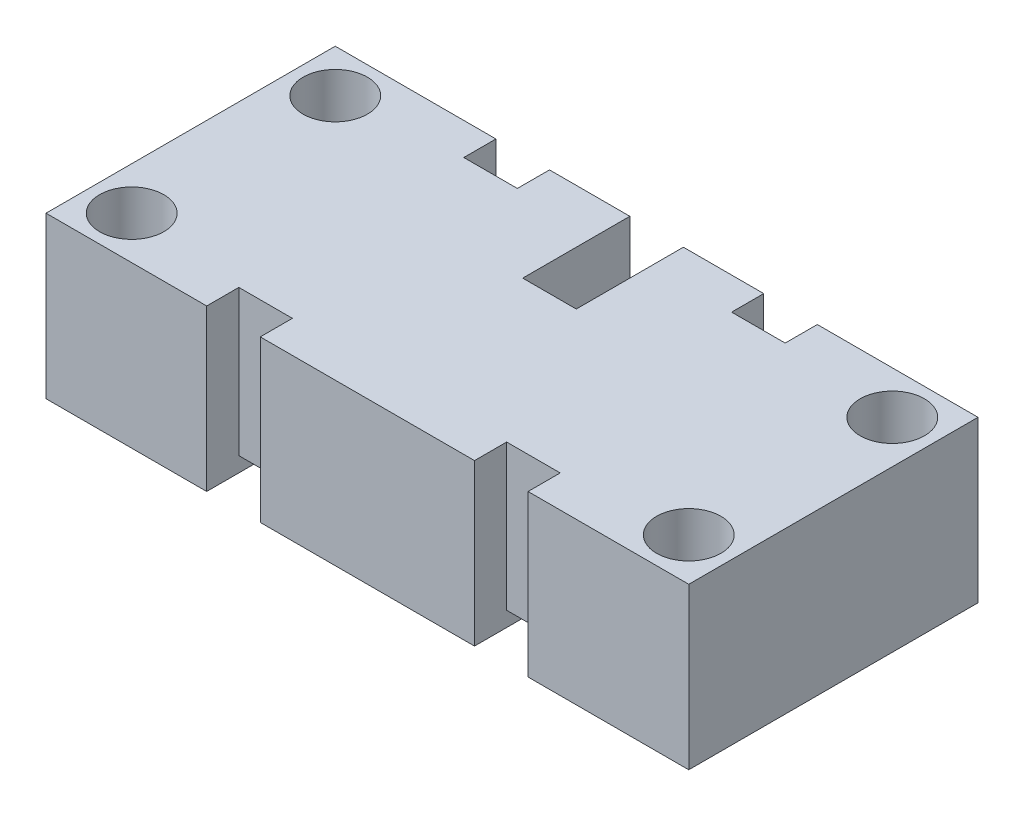
ISO-10303-21;
HEADER;
FILE_DESCRIPTION(('STEP AP214'),'2;1');
FILE_NAME('part.step','',(''),(''),'','','');
FILE_SCHEMA(('AUTOMOTIVE_DESIGN { 1 0 10303 214 1 1 1 1 }'));
ENDSEC;
DATA;
#1=APPLICATION_CONTEXT('core data for automotive mechanical design processes');
#2=APPLICATION_PROTOCOL_DEFINITION('international standard','automotive_design',2000,#1);
#3=PRODUCT_CONTEXT('',#1,'mechanical');
#4=PRODUCT('Part','Part','',(#3));
#5=PRODUCT_RELATED_PRODUCT_CATEGORY('part','',(#4));
#6=PRODUCT_DEFINITION_FORMATION('','',#4);
#7=PRODUCT_DEFINITION_CONTEXT('part definition',#1,'design');
#8=PRODUCT_DEFINITION('design','',#6,#7);
#9=PRODUCT_DEFINITION_SHAPE('','',#8);
#10=(LENGTH_UNIT() NAMED_UNIT(*) SI_UNIT(.MILLI.,.METRE.));
#11=(NAMED_UNIT(*) PLANE_ANGLE_UNIT() SI_UNIT($,.RADIAN.));
#12=(NAMED_UNIT(*) SI_UNIT($,.STERADIAN.) SOLID_ANGLE_UNIT());
#13=UNCERTAINTY_MEASURE_WITH_UNIT(LENGTH_MEASURE(1.E-05),#10,'distance_accuracy_value','');
#14=(GEOMETRIC_REPRESENTATION_CONTEXT(3) GLOBAL_UNCERTAINTY_ASSIGNED_CONTEXT((#13)) GLOBAL_UNIT_ASSIGNED_CONTEXT((#10,
#11,#12)) REPRESENTATION_CONTEXT('',''));
#15=CARTESIAN_POINT('',(0.,0.,0.));
#16=DIRECTION('',(0.,0.,1.));
#17=DIRECTION('',(1.,0.,0.));
#18=AXIS2_PLACEMENT_3D('',#15,#16,#17);
#19=CARTESIAN_POINT('',(0.,0.,0.));
#20=DIRECTION('',(0.,1.,0.));
#21=DIRECTION('',(0.,0.,1.));
#22=AXIS2_PLACEMENT_3D('',#19,#20,#21);
#23=PLANE('',#22);
#24=DIRECTION('',(0.,0.,1.));
#25=VECTOR('',#24,1.);
#26=CARTESIAN_POINT('',(19.4553191489362,0.,0.));
#27=LINE('',#26,#25);
#28=CARTESIAN_POINT('',(19.4553191489362,0.,-17.5818439716312));
#29=VERTEX_POINT('',#28);
#30=CARTESIAN_POINT('',(19.4553191489362,0.,16.7081560283688));
#31=VERTEX_POINT('',#30);
#32=EDGE_CURVE('E246',#29,#31,#27,.T.);
#33=ORIENTED_EDGE('',*,*,#32,.T.);
#34=DIRECTION('',(1.,0.,0.));
#35=VECTOR('',#34,1.);
#36=CARTESIAN_POINT('',(0.,0.,16.7081560283688));
#37=LINE('',#36,#35);
#38=CARTESIAN_POINT('',(-5.94468085106381,0.,16.7081560283688));
#39=VERTEX_POINT('',#38);
#40=EDGE_CURVE('E234',#39,#31,#37,.T.);
#41=ORIENTED_EDGE('',*,*,#40,.F.);
#42=DIRECTION('',(0.,0.,1.));
#43=VECTOR('',#42,1.);
#44=CARTESIAN_POINT('',(-5.94468085106381,0.,0.));
#45=LINE('',#44,#43);
#46=CARTESIAN_POINT('',(-5.94468085106381,0.,-17.5818439716312));
#47=VERTEX_POINT('',#46);
#48=EDGE_CURVE('E261',#47,#39,#45,.T.);
#49=ORIENTED_EDGE('',*,*,#48,.F.);
#50=DIRECTION('',(1.,0.,0.));
#51=VECTOR('',#50,1.);
#52=CARTESIAN_POINT('',(0.,0.,-17.5818439716312));
#53=LINE('',#52,#51);
#54=CARTESIAN_POINT('',(3.58031914893617,0.,-17.5818439716312));
#55=VERTEX_POINT('',#54);
#56=EDGE_CURVE('E258',#47,#55,#53,.T.);
#57=ORIENTED_EDGE('',*,*,#56,.T.);
#58=DIRECTION('',(0.,0.,1.));
#59=VECTOR('',#58,1.);
#60=CARTESIAN_POINT('',(3.58031914893618,0.,0.));
#61=LINE('',#60,#59);
#62=CARTESIAN_POINT('',(3.58031914893618,0.,-4.88184397163122));
#63=VERTEX_POINT('',#62);
#64=EDGE_CURVE('E255',#55,#63,#61,.T.);
#65=ORIENTED_EDGE('',*,*,#64,.T.);
#66=DIRECTION('',(1.,0.,0.));
#67=VECTOR('',#66,1.);
#68=CARTESIAN_POINT('',(0.,0.,-4.88184397163122));
#69=LINE('',#68,#67);
#70=CARTESIAN_POINT('',(9.93031914893618,0.,-4.88184397163121));
#71=VERTEX_POINT('',#70);
#72=EDGE_CURVE('E252',#63,#71,#69,.T.);
#73=ORIENTED_EDGE('',*,*,#72,.T.);
#74=DIRECTION('',(0.,0.,1.));
#75=VECTOR('',#74,1.);
#76=CARTESIAN_POINT('',(9.93031914893618,0.,0.));
#77=LINE('',#76,#75);
#78=CARTESIAN_POINT('',(9.93031914893617,0.,-17.5818439716312));
#79=VERTEX_POINT('',#78);
#80=EDGE_CURVE('E249',#79,#71,#77,.T.);
#81=ORIENTED_EDGE('',*,*,#80,.F.);
#82=DIRECTION('',(1.,0.,0.));
#83=VECTOR('',#82,1.);
#84=CARTESIAN_POINT('',(0.,0.,-17.5818439716312));
#85=LINE('',#84,#83);
#86=EDGE_CURVE('E243',#79,#29,#85,.T.);
#87=ORIENTED_EDGE('',*,*,#86,.T.);
#88=EDGE_LOOP('',(#33,#41,#49,#57,#65,#73,#81,#87));
#89=FACE_BOUND('',#88,.T.);
#90=ADVANCED_FACE('F35',(#89),#23,.F.);
#91=CARTESIAN_POINT('',(0.,19.05,12.8981560283689));
#92=DIRECTION('',(0.,0.,1.));
#93=DIRECTION('',(1.,0.,0.));
#94=AXIS2_PLACEMENT_3D('',#91,#92,#93);
#95=PLANE('',#94);
#96=DIRECTION('',(0.,-1.,0.));
#97=VECTOR('',#96,1.);
#98=CARTESIAN_POINT('',(19.4553191489362,19.05,12.8981560283688));
#99=LINE('',#98,#97);
#100=CARTESIAN_POINT('',(19.4553191489362,19.05,12.8981560283688));
#101=VERTEX_POINT('',#100);
#102=CARTESIAN_POINT('',(19.4553191489362,1.778,12.8981560283688));
#103=VERTEX_POINT('',#102);
#104=EDGE_CURVE('E300',#101,#103,#99,.T.);
#105=ORIENTED_EDGE('',*,*,#104,.T.);
#106=DIRECTION('',(1.,0.,0.));
#107=VECTOR('',#106,1.);
#108=CARTESIAN_POINT('',(0.,1.77800000000001,12.8981560283689));
#109=LINE('',#108,#107);
#110=CARTESIAN_POINT('',(25.8053191489362,1.778,12.8981560283688));
#111=VERTEX_POINT('',#110);
#112=EDGE_CURVE('E425',#103,#111,#109,.T.);
#113=ORIENTED_EDGE('',*,*,#112,.T.);
#114=DIRECTION('',(0.,-1.,0.));
#115=VECTOR('',#114,1.);
#116=CARTESIAN_POINT('',(25.8053191489362,19.05,12.8981560283688));
#117=LINE('',#116,#115);
#118=CARTESIAN_POINT('',(25.8053191489362,19.05,12.8981560283688));
#119=VERTEX_POINT('',#118);
#120=EDGE_CURVE('E298',#119,#111,#117,.T.);
#121=ORIENTED_EDGE('',*,*,#120,.F.);
#122=DIRECTION('',(-1.,0.,0.));
#123=VECTOR('',#122,1.);
#124=CARTESIAN_POINT('',(0.,19.05,12.8981560283689));
#125=LINE('',#124,#123);
#126=EDGE_CURVE('E355',#119,#101,#125,.T.);
#127=ORIENTED_EDGE('',*,*,#126,.T.);
#128=EDGE_LOOP('',(#105,#113,#121,#127));
#129=FACE_BOUND('',#128,.T.);
#130=ADVANCED_FACE('F528',(#129),#95,.T.);
#131=CARTESIAN_POINT('',(0.,19.05,-13.7718439716312));
#132=DIRECTION('',(0.,0.,-1.));
#133=DIRECTION('',(-1.,0.,0.));
#134=AXIS2_PLACEMENT_3D('',#131,#132,#133);
#135=PLANE('',#134);
#136=DIRECTION('',(0.,-1.,0.));
#137=VECTOR('',#136,1.);
#138=CARTESIAN_POINT('',(25.8053191489362,19.05,-13.7718439716312));
#139=LINE('',#138,#137);
#140=CARTESIAN_POINT('',(25.8053191489362,19.05,-13.7718439716312));
#141=VERTEX_POINT('',#140);
#142=CARTESIAN_POINT('',(25.8053191489362,1.77800000000001,-13.7718439716312));
#143=VERTEX_POINT('',#142);
#144=EDGE_CURVE('E286',#141,#143,#139,.T.);
#145=ORIENTED_EDGE('',*,*,#144,.T.);
#146=DIRECTION('',(-1.,0.,0.));
#147=VECTOR('',#146,1.);
#148=CARTESIAN_POINT('',(0.,1.77800000000001,-13.7718439716312));
#149=LINE('',#148,#147);
#150=CARTESIAN_POINT('',(19.4553191489362,1.778,-13.7718439716312));
#151=VERTEX_POINT('',#150);
#152=EDGE_CURVE('E423',#143,#151,#149,.T.);
#153=ORIENTED_EDGE('',*,*,#152,.T.);
#154=DIRECTION('',(0.,-1.,0.));
#155=VECTOR('',#154,1.);
#156=CARTESIAN_POINT('',(19.4553191489362,19.05,-13.7718439716312));
#157=LINE('',#156,#155);
#158=CARTESIAN_POINT('',(19.4553191489362,19.05,-13.7718439716312));
#159=VERTEX_POINT('',#158);
#160=EDGE_CURVE('E283',#159,#151,#157,.T.);
#161=ORIENTED_EDGE('',*,*,#160,.F.);
#162=DIRECTION('',(1.,0.,0.));
#163=VECTOR('',#162,1.);
#164=CARTESIAN_POINT('',(0.,19.05,-13.7718439716312));
#165=LINE('',#164,#163);
#166=EDGE_CURVE('E370',#159,#141,#165,.T.);
#167=ORIENTED_EDGE('',*,*,#166,.T.);
#168=EDGE_LOOP('',(#145,#153,#161,#167));
#169=FACE_BOUND('',#168,.T.);
#170=ADVANCED_FACE('F430',(#169),#135,.T.);
#171=CARTESIAN_POINT('',(0.,19.05,12.8981560283688));
#172=DIRECTION('',(0.,0.,-1.));
#173=DIRECTION('',(-1.,0.,0.));
#174=AXIS2_PLACEMENT_3D('',#171,#172,#173);
#175=PLANE('',#174);
#176=DIRECTION('',(-1.,0.,0.));
#177=VECTOR('',#176,1.);
#178=CARTESIAN_POINT('',(0.,1.778,12.8981560283688));
#179=LINE('',#178,#177);
#180=CARTESIAN_POINT('',(-5.94468085106381,1.778,12.8981560283688));
#181=VERTEX_POINT('',#180);
#182=CARTESIAN_POINT('',(-12.2946808510638,1.778,12.8981560283688));
#183=VERTEX_POINT('',#182);
#184=EDGE_CURVE('E480',#181,#183,#179,.T.);
#185=ORIENTED_EDGE('',*,*,#184,.F.);
#186=DIRECTION('',(0.,-1.,0.));
#187=VECTOR('',#186,1.);
#188=CARTESIAN_POINT('',(-5.94468085106381,19.05,12.8981560283688));
#189=LINE('',#188,#187);
#190=CARTESIAN_POINT('',(-5.94468085106381,19.05,12.8981560283688));
#191=VERTEX_POINT('',#190);
#192=EDGE_CURVE('E307',#191,#181,#189,.T.);
#193=ORIENTED_EDGE('',*,*,#192,.F.);
#194=DIRECTION('',(1.,0.,0.));
#195=VECTOR('',#194,1.);
#196=CARTESIAN_POINT('',(0.,19.05,12.8981560283688));
#197=LINE('',#196,#195);
#198=CARTESIAN_POINT('',(-12.2946808510638,19.05,12.8981560283688));
#199=VERTEX_POINT('',#198);
#200=EDGE_CURVE('E348',#199,#191,#197,.T.);
#201=ORIENTED_EDGE('',*,*,#200,.F.);
#202=DIRECTION('',(0.,-1.,0.));
#203=VECTOR('',#202,1.);
#204=CARTESIAN_POINT('',(-12.2946808510638,19.05,12.8981560283688));
#205=LINE('',#204,#203);
#206=EDGE_CURVE('E310',#199,#183,#205,.T.);
#207=ORIENTED_EDGE('',*,*,#206,.T.);
#208=EDGE_LOOP('',(#185,#193,#201,#207));
#209=FACE_BOUND('',#208,.T.);
#210=ADVANCED_FACE('F479',(#209),#175,.F.);
#211=CARTESIAN_POINT('',(0.,19.05,-13.7718439716312));
#212=DIRECTION('',(0.,0.,-1.));
#213=DIRECTION('',(-1.,0.,0.));
#214=AXIS2_PLACEMENT_3D('',#211,#212,#213);
#215=PLANE('',#214);
#216=DIRECTION('',(0.,-1.,0.));
#217=VECTOR('',#216,1.);
#218=CARTESIAN_POINT('',(-5.94468085106381,19.05,-13.7718439716312));
#219=LINE('',#218,#217);
#220=CARTESIAN_POINT('',(-5.94468085106381,19.05,-13.7718439716312));
#221=VERTEX_POINT('',#220);
#222=CARTESIAN_POINT('',(-5.94468085106381,1.778,-13.7718439716312));
#223=VERTEX_POINT('',#222);
#224=EDGE_CURVE('E200',#221,#223,#219,.T.);
#225=ORIENTED_EDGE('',*,*,#224,.T.);
#226=DIRECTION('',(-1.,0.,0.));
#227=VECTOR('',#226,1.);
#228=CARTESIAN_POINT('',(0.,1.778,-13.7718439716312));
#229=LINE('',#228,#227);
#230=CARTESIAN_POINT('',(-12.2946808510638,1.778,-13.7718439716312));
#231=VERTEX_POINT('',#230);
#232=EDGE_CURVE('E196',#223,#231,#229,.T.);
#233=ORIENTED_EDGE('',*,*,#232,.T.);
#234=DIRECTION('',(0.,-1.,0.));
#235=VECTOR('',#234,1.);
#236=CARTESIAN_POINT('',(-12.2946808510638,19.05,-13.7718439716312));
#237=LINE('',#236,#235);
#238=CARTESIAN_POINT('',(-12.2946808510638,19.05,-13.7718439716312));
#239=VERTEX_POINT('',#238);
#240=EDGE_CURVE('E189',#239,#231,#237,.T.);
#241=ORIENTED_EDGE('',*,*,#240,.F.);
#242=DIRECTION('',(1.,0.,0.));
#243=VECTOR('',#242,1.);
#244=CARTESIAN_POINT('',(0.,19.05,-13.7718439716312));
#245=LINE('',#244,#243);
#246=EDGE_CURVE('E193',#239,#221,#245,.T.);
#247=ORIENTED_EDGE('',*,*,#246,.T.);
#248=EDGE_LOOP('',(#225,#233,#241,#247));
#249=FACE_BOUND('',#248,.T.);
#250=ADVANCED_FACE('F192',(#249),#215,.T.);
#251=CARTESIAN_POINT('',(39.7753191489362,0.,11.6281560283688));
#252=DIRECTION('',(0.,1.,0.));
#253=DIRECTION('',(0.,0.,1.));
#254=AXIS2_PLACEMENT_3D('',#251,#252,#253);
#255=CIRCLE('',#254,2.159);
#256=CARTESIAN_POINT('',(39.7753191489362,0.,13.7871560283688));
#257=VERTEX_POINT('',#256);
#258=EDGE_CURVE('E482',#257,#257,#255,.T.);
#259=ORIENTED_EDGE('',*,*,#258,.T.);
#260=EDGE_LOOP('',(#259));
#261=FACE_BOUND('',#260,.T.);
#262=CARTESIAN_POINT('',(39.7753191489362,0.,-12.5018439716312));
#263=DIRECTION('',(0.,1.,0.));
#264=DIRECTION('',(0.,0.,1.));
#265=AXIS2_PLACEMENT_3D('',#262,#263,#264);
#266=CIRCLE('',#265,2.159);
#267=CARTESIAN_POINT('',(39.7753191489362,0.,-10.3428439716312));
#268=VERTEX_POINT('',#267);
#269=EDGE_CURVE('E491',#268,#268,#266,.T.);
#270=ORIENTED_EDGE('',*,*,#269,.T.);
#271=EDGE_LOOP('',(#270));
#272=FACE_BOUND('',#271,.T.);
#273=CARTESIAN_POINT('',(25.8053191489362,0.,16.7081560283688));
#274=VERTEX_POINT('',#273);
#275=CARTESIAN_POINT('',(44.8553191489362,0.,16.7081560283688));
#276=VERTEX_POINT('',#275);
#277=EDGE_CURVE('E235',#274,#276,#37,.T.);
#278=ORIENTED_EDGE('',*,*,#277,.F.);
#279=DIRECTION('',(0.,0.,-1.));
#280=VECTOR('',#279,1.);
#281=CARTESIAN_POINT('',(25.8053191489362,0.,0.));
#282=LINE('',#281,#280);
#283=CARTESIAN_POINT('',(25.8053191489362,0.,-17.5818439716312));
#284=VERTEX_POINT('',#283);
#285=EDGE_CURVE('E242',#274,#284,#282,.T.);
#286=ORIENTED_EDGE('',*,*,#285,.T.);
#287=CARTESIAN_POINT('',(44.8553191489362,0.,-17.5818439716312));
#288=VERTEX_POINT('',#287);
#289=EDGE_CURVE('E239',#284,#288,#85,.T.);
#290=ORIENTED_EDGE('',*,*,#289,.T.);
#291=DIRECTION('',(0.,0.,1.));
#292=VECTOR('',#291,1.);
#293=CARTESIAN_POINT('',(44.8553191489362,0.,0.));
#294=LINE('',#293,#292);
#295=EDGE_CURVE('E236',#288,#276,#294,.T.);
#296=ORIENTED_EDGE('',*,*,#295,.T.);
#297=EDGE_LOOP('',(#278,#286,#290,#296));
#298=FACE_BOUND('',#297,.T.);
#299=ADVANCED_FACE('F463',(#261,#272,#298),#23,.F.);
#300=CARTESIAN_POINT('',(-26.2646808510638,0.,11.6281560283688));
#301=DIRECTION('',(0.,1.,0.));
#302=DIRECTION('',(0.,0.,1.));
#303=AXIS2_PLACEMENT_3D('',#300,#301,#302);
#304=CIRCLE('',#303,2.159);
#305=CARTESIAN_POINT('',(-26.2646808510638,0.,13.7871560283688));
#306=VERTEX_POINT('',#305);
#307=EDGE_CURVE('E496',#306,#306,#304,.T.);
#308=ORIENTED_EDGE('',*,*,#307,.T.);
#309=EDGE_LOOP('',(#308));
#310=FACE_BOUND('',#309,.T.);
#311=CARTESIAN_POINT('',(-26.2646808510638,0.,-12.5018439716312));
#312=DIRECTION('',(0.,1.,0.));
#313=DIRECTION('',(0.,0.,1.));
#314=AXIS2_PLACEMENT_3D('',#311,#312,#313);
#315=CIRCLE('',#314,2.159);
#316=CARTESIAN_POINT('',(-26.2646808510638,0.,-10.3428439716312));
#317=VERTEX_POINT('',#316);
#318=EDGE_CURVE('E502',#317,#317,#315,.T.);
#319=ORIENTED_EDGE('',*,*,#318,.T.);
#320=EDGE_LOOP('',(#319));
#321=FACE_BOUND('',#320,.T.);
#322=DIRECTION('',(0.,0.,1.));
#323=VECTOR('',#322,1.);
#324=CARTESIAN_POINT('',(-12.2946808510638,0.,0.));
#325=LINE('',#324,#323);
#326=CARTESIAN_POINT('',(-12.2946808510638,0.,-17.5818439716312));
#327=VERTEX_POINT('',#326);
#328=CARTESIAN_POINT('',(-12.2946808510638,0.,16.7081560283688));
#329=VERTEX_POINT('',#328);
#330=EDGE_CURVE('E265',#327,#329,#325,.T.);
#331=ORIENTED_EDGE('',*,*,#330,.T.);
#332=CARTESIAN_POINT('',(-31.3446808510638,0.,16.7081560283688));
#333=VERTEX_POINT('',#332);
#334=EDGE_CURVE('E230',#333,#329,#37,.T.);
#335=ORIENTED_EDGE('',*,*,#334,.F.);
#336=DIRECTION('',(0.,0.,1.));
#337=VECTOR('',#336,1.);
#338=CARTESIAN_POINT('',(-31.3446808510638,0.,0.));
#339=LINE('',#338,#337);
#340=CARTESIAN_POINT('',(-31.3446808510638,0.,-17.5818439716312));
#341=VERTEX_POINT('',#340);
#342=EDGE_CURVE('E228',#341,#333,#339,.T.);
#343=ORIENTED_EDGE('',*,*,#342,.F.);
#344=EDGE_CURVE('E262',#341,#327,#53,.T.);
#345=ORIENTED_EDGE('',*,*,#344,.T.);
#346=EDGE_LOOP('',(#331,#335,#343,#345));
#347=FACE_BOUND('',#346,.T.);
#348=ADVANCED_FACE('F509',(#310,#321,#347),#23,.F.);
#349=CARTESIAN_POINT('',(-31.3446808510638,19.05,0.));
#350=DIRECTION('',(1.,0.,0.));
#351=DIRECTION('',(0.,0.,-1.));
#352=AXIS2_PLACEMENT_3D('',#349,#350,#351);
#353=PLANE('',#352);
#354=ORIENTED_EDGE('',*,*,#342,.T.);
#355=DIRECTION('',(0.,-1.,0.));
#356=VECTOR('',#355,1.);
#357=CARTESIAN_POINT('',(-31.3446808510638,19.05,16.7081560283688));
#358=LINE('',#357,#356);
#359=CARTESIAN_POINT('',(-31.3446808510638,19.05,16.7081560283688));
#360=VERTEX_POINT('',#359);
#361=EDGE_CURVE('E315',#360,#333,#358,.T.);
#362=ORIENTED_EDGE('',*,*,#361,.F.);
#363=DIRECTION('',(0.,0.,1.));
#364=VECTOR('',#363,1.);
#365=CARTESIAN_POINT('',(-31.3446808510638,19.05,0.));
#366=LINE('',#365,#364);
#367=CARTESIAN_POINT('',(-31.3446808510638,19.05,-17.5818439716312));
#368=VERTEX_POINT('',#367);
#369=EDGE_CURVE('E335',#368,#360,#366,.T.);
#370=ORIENTED_EDGE('',*,*,#369,.F.);
#371=DIRECTION('',(0.,-1.,0.));
#372=VECTOR('',#371,1.);
#373=CARTESIAN_POINT('',(-31.3446808510638,19.05,-17.5818439716312));
#374=LINE('',#373,#372);
#375=EDGE_CURVE('E59',#368,#341,#374,.T.);
#376=ORIENTED_EDGE('',*,*,#375,.T.);
#377=EDGE_LOOP('',(#354,#362,#370,#376));
#378=FACE_BOUND('',#377,.T.);
#379=ADVANCED_FACE('F537',(#378),#353,.F.);
#380=CARTESIAN_POINT('',(0.,19.05,16.7081560283688));
#381=DIRECTION('',(0.,0.,-1.));
#382=DIRECTION('',(-1.,0.,0.));
#383=AXIS2_PLACEMENT_3D('',#380,#381,#382);
#384=PLANE('',#383);
#385=ORIENTED_EDGE('',*,*,#334,.T.);
#386=DIRECTION('',(0.,-1.,0.));
#387=VECTOR('',#386,1.);
#388=CARTESIAN_POINT('',(-12.2946808510638,19.05,16.7081560283688));
#389=LINE('',#388,#387);
#390=CARTESIAN_POINT('',(-12.2946808510638,19.05,16.7081560283688));
#391=VERTEX_POINT('',#390);
#392=EDGE_CURVE('E313',#391,#329,#389,.T.);
#393=ORIENTED_EDGE('',*,*,#392,.F.);
#394=DIRECTION('',(1.,0.,0.));
#395=VECTOR('',#394,1.);
#396=CARTESIAN_POINT('',(0.,19.05,16.7081560283688));
#397=LINE('',#396,#395);
#398=EDGE_CURVE('E123',#360,#391,#397,.T.);
#399=ORIENTED_EDGE('',*,*,#398,.F.);
#400=ORIENTED_EDGE('',*,*,#361,.T.);
#401=EDGE_LOOP('',(#385,#393,#399,#400));
#402=FACE_BOUND('',#401,.T.);
#403=ADVANCED_FACE('F611',(#402),#384,.F.);
#404=ORIENTED_EDGE('',*,*,#40,.T.);
#405=DIRECTION('',(0.,-1.,0.));
#406=VECTOR('',#405,1.);
#407=CARTESIAN_POINT('',(19.4553191489362,19.05,16.7081560283688));
#408=LINE('',#407,#406);
#409=CARTESIAN_POINT('',(19.4553191489362,19.05,16.7081560283688));
#410=VERTEX_POINT('',#409);
#411=EDGE_CURVE('E303',#410,#31,#408,.T.);
#412=ORIENTED_EDGE('',*,*,#411,.F.);
#413=CARTESIAN_POINT('',(-5.94468085106381,19.05,16.7081560283688));
#414=VERTEX_POINT('',#413);
#415=EDGE_CURVE('E346',#414,#410,#397,.T.);
#416=ORIENTED_EDGE('',*,*,#415,.F.);
#417=DIRECTION('',(0.,-1.,0.));
#418=VECTOR('',#417,1.);
#419=CARTESIAN_POINT('',(-5.94468085106381,19.05,16.7081560283688));
#420=LINE('',#419,#418);
#421=EDGE_CURVE('E305',#414,#39,#420,.T.);
#422=ORIENTED_EDGE('',*,*,#421,.T.);
#423=EDGE_LOOP('',(#404,#412,#416,#422));
#424=FACE_BOUND('',#423,.T.);
#425=ADVANCED_FACE('F452',(#424),#384,.F.);
#426=ORIENTED_EDGE('',*,*,#277,.T.);
#427=DIRECTION('',(0.,-1.,0.));
#428=VECTOR('',#427,1.);
#429=CARTESIAN_POINT('',(44.8553191489362,19.05,16.7081560283688));
#430=LINE('',#429,#428);
#431=CARTESIAN_POINT('',(44.8553191489362,19.05,16.7081560283688));
#432=VERTEX_POINT('',#431);
#433=EDGE_CURVE('E293',#432,#276,#430,.T.);
#434=ORIENTED_EDGE('',*,*,#433,.F.);
#435=CARTESIAN_POINT('',(25.8053191489362,19.05,16.7081560283688));
#436=VERTEX_POINT('',#435);
#437=EDGE_CURVE('E345',#436,#432,#397,.T.);
#438=ORIENTED_EDGE('',*,*,#437,.F.);
#439=DIRECTION('',(0.,-1.,0.));
#440=VECTOR('',#439,1.);
#441=CARTESIAN_POINT('',(25.8053191489362,19.05,16.7081560283688));
#442=LINE('',#441,#440);
#443=EDGE_CURVE('E295',#436,#274,#442,.T.);
#444=ORIENTED_EDGE('',*,*,#443,.T.);
#445=EDGE_LOOP('',(#426,#434,#438,#444));
#446=FACE_BOUND('',#445,.T.);
#447=ADVANCED_FACE('F458',(#446),#384,.F.);
#448=CARTESIAN_POINT('',(44.8553191489362,19.05,0.));
#449=DIRECTION('',(1.,0.,0.));
#450=DIRECTION('',(0.,0.,-1.));
#451=AXIS2_PLACEMENT_3D('',#448,#449,#450);
#452=PLANE('',#451);
#453=ORIENTED_EDGE('',*,*,#295,.F.);
#454=DIRECTION('',(0.,-1.,0.));
#455=VECTOR('',#454,1.);
#456=CARTESIAN_POINT('',(44.8553191489362,19.05,-17.5818439716312));
#457=LINE('',#456,#455);
#458=CARTESIAN_POINT('',(44.8553191489362,19.05,-17.5818439716312));
#459=VERTEX_POINT('',#458);
#460=EDGE_CURVE('E291',#459,#288,#457,.T.);
#461=ORIENTED_EDGE('',*,*,#460,.F.);
#462=DIRECTION('',(0.,0.,1.));
#463=VECTOR('',#462,1.);
#464=CARTESIAN_POINT('',(44.8553191489362,19.05,0.));
#465=LINE('',#464,#463);
#466=EDGE_CURVE('E360',#459,#432,#465,.T.);
#467=ORIENTED_EDGE('',*,*,#466,.T.);
#468=ORIENTED_EDGE('',*,*,#433,.T.);
#469=EDGE_LOOP('',(#453,#461,#467,#468));
#470=FACE_BOUND('',#469,.T.);
#471=ADVANCED_FACE('F466',(#470),#452,.T.);
#472=CARTESIAN_POINT('',(0.,19.05,-17.5818439716312));
#473=DIRECTION('',(0.,0.,-1.));
#474=DIRECTION('',(-1.,0.,0.));
#475=AXIS2_PLACEMENT_3D('',#472,#473,#474);
#476=PLANE('',#475);
#477=ORIENTED_EDGE('',*,*,#289,.F.);
#478=DIRECTION('',(0.,-1.,0.));
#479=VECTOR('',#478,1.);
#480=CARTESIAN_POINT('',(25.8053191489362,19.05,-17.5818439716312));
#481=LINE('',#480,#479);
#482=CARTESIAN_POINT('',(25.8053191489362,19.05,-17.5818439716312));
#483=VERTEX_POINT('',#482);
#484=EDGE_CURVE('E289',#483,#284,#481,.T.);
#485=ORIENTED_EDGE('',*,*,#484,.F.);
#486=DIRECTION('',(1.,0.,0.));
#487=VECTOR('',#486,1.);
#488=CARTESIAN_POINT('',(0.,19.05,-17.5818439716312));
#489=LINE('',#488,#487);
#490=EDGE_CURVE('E363',#483,#459,#489,.T.);
#491=ORIENTED_EDGE('',*,*,#490,.T.);
#492=ORIENTED_EDGE('',*,*,#460,.T.);
#493=EDGE_LOOP('',(#477,#485,#491,#492));
#494=FACE_BOUND('',#493,.T.);
#495=ADVANCED_FACE('F470',(#494),#476,.T.);
#496=CARTESIAN_POINT('',(25.8053191489362,19.05,0.));
#497=DIRECTION('',(-1.,0.,0.));
#498=DIRECTION('',(0.,0.,1.));
#499=AXIS2_PLACEMENT_3D('',#496,#497,#498);
#500=PLANE('',#499);
#501=DIRECTION('',(0.,0.,1.));
#502=VECTOR('',#501,1.);
#503=CARTESIAN_POINT('',(25.8053191489362,1.778,-17.5818439716312));
#504=LINE('',#503,#502);
#505=EDGE_CURVE('E50',#143,#111,#504,.T.);
#506=ORIENTED_EDGE('',*,*,#505,.F.);
#507=ORIENTED_EDGE('',*,*,#144,.F.);
#508=DIRECTION('',(0.,0.,-1.));
#509=VECTOR('',#508,1.);
#510=CARTESIAN_POINT('',(25.8053191489362,19.05,0.));
#511=LINE('',#510,#509);
#512=EDGE_CURVE('E366',#141,#483,#511,.T.);
#513=ORIENTED_EDGE('',*,*,#512,.T.);
#514=ORIENTED_EDGE('',*,*,#484,.T.);
#515=ORIENTED_EDGE('',*,*,#285,.F.);
#516=ORIENTED_EDGE('',*,*,#443,.F.);
#517=DIRECTION('',(0.,0.,1.));
#518=VECTOR('',#517,1.);
#519=CARTESIAN_POINT('',(25.8053191489362,19.05,0.));
#520=LINE('',#519,#518);
#521=EDGE_CURVE('E358',#119,#436,#520,.T.);
#522=ORIENTED_EDGE('',*,*,#521,.F.);
#523=ORIENTED_EDGE('',*,*,#120,.T.);
#524=EDGE_LOOP('',(#506,#507,#513,#514,#515,#516,#522,#523));
#525=FACE_BOUND('',#524,.T.);
#526=ADVANCED_FACE('F471',(#525),#500,.T.);
#527=CARTESIAN_POINT('',(19.4553191489362,19.05,0.));
#528=DIRECTION('',(1.,0.,0.));
#529=DIRECTION('',(0.,0.,-1.));
#530=AXIS2_PLACEMENT_3D('',#527,#528,#529);
#531=PLANE('',#530);
#532=ORIENTED_EDGE('',*,*,#32,.F.);
#533=DIRECTION('',(0.,-1.,0.));
#534=VECTOR('',#533,1.);
#535=CARTESIAN_POINT('',(19.4553191489362,19.05,-17.5818439716312));
#536=LINE('',#535,#534);
#537=CARTESIAN_POINT('',(19.4553191489362,19.05,-17.5818439716312));
#538=VERTEX_POINT('',#537);
#539=EDGE_CURVE('E281',#538,#29,#536,.T.);
#540=ORIENTED_EDGE('',*,*,#539,.F.);
#541=DIRECTION('',(0.,0.,1.));
#542=VECTOR('',#541,1.);
#543=CARTESIAN_POINT('',(19.4553191489362,19.05,0.));
#544=LINE('',#543,#542);
#545=EDGE_CURVE('E373',#538,#159,#544,.T.);
#546=ORIENTED_EDGE('',*,*,#545,.T.);
#547=ORIENTED_EDGE('',*,*,#160,.T.);
#548=DIRECTION('',(0.,0.,1.));
#549=VECTOR('',#548,1.);
#550=CARTESIAN_POINT('',(19.4553191489362,1.778,-17.5818439716312));
#551=LINE('',#550,#549);
#552=EDGE_CURVE('E420',#151,#103,#551,.T.);
#553=ORIENTED_EDGE('',*,*,#552,.T.);
#554=ORIENTED_EDGE('',*,*,#104,.F.);
#555=DIRECTION('',(0.,0.,-1.));
#556=VECTOR('',#555,1.);
#557=CARTESIAN_POINT('',(19.4553191489362,19.05,0.));
#558=LINE('',#557,#556);
#559=EDGE_CURVE('E353',#410,#101,#558,.T.);
#560=ORIENTED_EDGE('',*,*,#559,.F.);
#561=ORIENTED_EDGE('',*,*,#411,.T.);
#562=EDGE_LOOP('',(#532,#540,#546,#547,#553,#554,#560,#561));
#563=FACE_BOUND('',#562,.T.);
#564=ADVANCED_FACE('F434',(#563),#531,.T.);
#565=ORIENTED_EDGE('',*,*,#86,.F.);
#566=DIRECTION('',(0.,-1.,0.));
#567=VECTOR('',#566,1.);
#568=CARTESIAN_POINT('',(9.93031914893617,19.05,-17.5818439716312));
#569=LINE('',#568,#567);
#570=CARTESIAN_POINT('',(9.93031914893617,19.05,-17.5818439716312));
#571=VERTEX_POINT('',#570);
#572=EDGE_CURVE('E279',#571,#79,#569,.T.);
#573=ORIENTED_EDGE('',*,*,#572,.F.);
#574=EDGE_CURVE('E367',#571,#538,#489,.T.);
#575=ORIENTED_EDGE('',*,*,#574,.T.);
#576=ORIENTED_EDGE('',*,*,#539,.T.);
#577=EDGE_LOOP('',(#565,#573,#575,#576));
#578=FACE_BOUND('',#577,.T.);
#579=ADVANCED_FACE('F441',(#578),#476,.T.);
#580=CARTESIAN_POINT('',(9.93031914893618,19.05,0.));
#581=DIRECTION('',(1.,0.,0.));
#582=DIRECTION('',(0.,0.,-1.));
#583=AXIS2_PLACEMENT_3D('',#580,#581,#582);
#584=PLANE('',#583);
#585=ORIENTED_EDGE('',*,*,#80,.T.);
#586=DIRECTION('',(0.,-1.,0.));
#587=VECTOR('',#586,1.);
#588=CARTESIAN_POINT('',(9.93031914893618,19.05,-4.88184397163121));
#589=LINE('',#588,#587);
#590=CARTESIAN_POINT('',(9.93031914893618,19.05,-4.88184397163121));
#591=VERTEX_POINT('',#590);
#592=EDGE_CURVE('E277',#591,#71,#589,.T.);
#593=ORIENTED_EDGE('',*,*,#592,.F.);
#594=DIRECTION('',(0.,0.,1.));
#595=VECTOR('',#594,1.);
#596=CARTESIAN_POINT('',(9.93031914893618,19.05,0.));
#597=LINE('',#596,#595);
#598=EDGE_CURVE('E376',#571,#591,#597,.T.);
#599=ORIENTED_EDGE('',*,*,#598,.F.);
#600=ORIENTED_EDGE('',*,*,#572,.T.);
#601=EDGE_LOOP('',(#585,#593,#599,#600));
#602=FACE_BOUND('',#601,.T.);
#603=ADVANCED_FACE('F447',(#602),#584,.F.);
#604=CARTESIAN_POINT('',(0.,19.05,-4.88184397163122));
#605=DIRECTION('',(0.,0.,-1.));
#606=DIRECTION('',(-1.,0.,0.));
#607=AXIS2_PLACEMENT_3D('',#604,#605,#606);
#608=PLANE('',#607);
#609=ORIENTED_EDGE('',*,*,#72,.F.);
#610=DIRECTION('',(0.,-1.,0.));
#611=VECTOR('',#610,1.);
#612=CARTESIAN_POINT('',(3.58031914893618,19.05,-4.88184397163122));
#613=LINE('',#612,#611);
#614=CARTESIAN_POINT('',(3.58031914893618,19.05,-4.88184397163122));
#615=VERTEX_POINT('',#614);
#616=EDGE_CURVE('E275',#615,#63,#613,.T.);
#617=ORIENTED_EDGE('',*,*,#616,.F.);
#618=DIRECTION('',(1.,0.,0.));
#619=VECTOR('',#618,1.);
#620=CARTESIAN_POINT('',(0.,19.05,-4.88184397163122));
#621=LINE('',#620,#619);
#622=EDGE_CURVE('E378',#615,#591,#621,.T.);
#623=ORIENTED_EDGE('',*,*,#622,.T.);
#624=ORIENTED_EDGE('',*,*,#592,.T.);
#625=EDGE_LOOP('',(#609,#617,#623,#624));
#626=FACE_BOUND('',#625,.T.);
#627=ADVANCED_FACE('F449',(#626),#608,.T.);
#628=CARTESIAN_POINT('',(3.58031914893618,19.05,0.));
#629=DIRECTION('',(1.,0.,0.));
#630=DIRECTION('',(0.,0.,-1.));
#631=AXIS2_PLACEMENT_3D('',#628,#629,#630);
#632=PLANE('',#631);
#633=ORIENTED_EDGE('',*,*,#64,.F.);
#634=DIRECTION('',(0.,-1.,0.));
#635=VECTOR('',#634,1.);
#636=CARTESIAN_POINT('',(3.58031914893617,19.05,-17.5818439716312));
#637=LINE('',#636,#635);
#638=CARTESIAN_POINT('',(3.58031914893617,19.05,-17.5818439716312));
#639=VERTEX_POINT('',#638);
#640=EDGE_CURVE('E273',#639,#55,#637,.T.);
#641=ORIENTED_EDGE('',*,*,#640,.F.);
#642=DIRECTION('',(0.,0.,1.));
#643=VECTOR('',#642,1.);
#644=CARTESIAN_POINT('',(3.58031914893618,19.05,0.));
#645=LINE('',#644,#643);
#646=EDGE_CURVE('E381',#639,#615,#645,.T.);
#647=ORIENTED_EDGE('',*,*,#646,.T.);
#648=ORIENTED_EDGE('',*,*,#616,.T.);
#649=EDGE_LOOP('',(#633,#641,#647,#648));
#650=FACE_BOUND('',#649,.T.);
#651=ADVANCED_FACE('F391',(#650),#632,.T.);
#652=CARTESIAN_POINT('',(0.,19.05,-17.5818439716312));
#653=DIRECTION('',(0.,0.,-1.));
#654=DIRECTION('',(-1.,0.,0.));
#655=AXIS2_PLACEMENT_3D('',#652,#653,#654);
#656=PLANE('',#655);
#657=ORIENTED_EDGE('',*,*,#56,.F.);
#658=DIRECTION('',(0.,-1.,0.));
#659=VECTOR('',#658,1.);
#660=CARTESIAN_POINT('',(-5.94468085106381,19.05,-17.5818439716312));
#661=LINE('',#660,#659);
#662=CARTESIAN_POINT('',(-5.94468085106381,19.05,-17.5818439716312));
#663=VERTEX_POINT('',#662);
#664=EDGE_CURVE('E271',#663,#47,#661,.T.);
#665=ORIENTED_EDGE('',*,*,#664,.F.);
#666=DIRECTION('',(1.,0.,0.));
#667=VECTOR('',#666,1.);
#668=CARTESIAN_POINT('',(0.,19.05,-17.5818439716312));
#669=LINE('',#668,#667);
#670=EDGE_CURVE('E220',#663,#639,#669,.T.);
#671=ORIENTED_EDGE('',*,*,#670,.T.);
#672=ORIENTED_EDGE('',*,*,#640,.T.);
#673=EDGE_LOOP('',(#657,#665,#671,#672));
#674=FACE_BOUND('',#673,.T.);
#675=ADVANCED_FACE('F386',(#674),#656,.T.);
#676=CARTESIAN_POINT('',(-5.94468085106381,19.05,0.));
#677=DIRECTION('',(1.,0.,0.));
#678=DIRECTION('',(0.,0.,-1.));
#679=AXIS2_PLACEMENT_3D('',#676,#677,#678);
#680=PLANE('',#679);
#681=ORIENTED_EDGE('',*,*,#48,.T.);
#682=ORIENTED_EDGE('',*,*,#421,.F.);
#683=DIRECTION('',(0.,0.,-1.));
#684=VECTOR('',#683,1.);
#685=CARTESIAN_POINT('',(-5.94468085106381,19.05,0.));
#686=LINE('',#685,#684);
#687=EDGE_CURVE('E350',#414,#191,#686,.T.);
#688=ORIENTED_EDGE('',*,*,#687,.T.);
#689=ORIENTED_EDGE('',*,*,#192,.T.);
#690=DIRECTION('',(0.,0.,1.));
#691=VECTOR('',#690,1.);
#692=CARTESIAN_POINT('',(-5.94468085106381,1.778,-17.5818439716312));
#693=LINE('',#692,#691);
#694=EDGE_CURVE('E403',#223,#181,#693,.T.);
#695=ORIENTED_EDGE('',*,*,#694,.F.);
#696=ORIENTED_EDGE('',*,*,#224,.F.);
#697=DIRECTION('',(0.,0.,1.));
#698=VECTOR('',#697,1.);
#699=CARTESIAN_POINT('',(-5.94468085106381,19.05,0.));
#700=LINE('',#699,#698);
#701=EDGE_CURVE('E211',#663,#221,#700,.T.);
#702=ORIENTED_EDGE('',*,*,#701,.F.);
#703=ORIENTED_EDGE('',*,*,#664,.T.);
#704=EDGE_LOOP('',(#681,#682,#688,#689,#695,#696,#702,#703));
#705=FACE_BOUND('',#704,.T.);
#706=ADVANCED_FACE('F398',(#705),#680,.F.);
#707=CARTESIAN_POINT('',(-12.2946808510638,19.05,0.));
#708=DIRECTION('',(1.,0.,0.));
#709=DIRECTION('',(0.,0.,-1.));
#710=AXIS2_PLACEMENT_3D('',#707,#708,#709);
#711=PLANE('',#710);
#712=ORIENTED_EDGE('',*,*,#330,.F.);
#713=DIRECTION('',(0.,-1.,0.));
#714=VECTOR('',#713,1.);
#715=CARTESIAN_POINT('',(-12.2946808510638,19.05,-17.5818439716312));
#716=LINE('',#715,#714);
#717=CARTESIAN_POINT('',(-12.2946808510638,19.05,-17.5818439716312));
#718=VERTEX_POINT('',#717);
#719=EDGE_CURVE('E201',#718,#327,#716,.T.);
#720=ORIENTED_EDGE('',*,*,#719,.F.);
#721=DIRECTION('',(0.,0.,1.));
#722=VECTOR('',#721,1.);
#723=CARTESIAN_POINT('',(-12.2946808510638,19.05,0.));
#724=LINE('',#723,#722);
#725=EDGE_CURVE('E208',#718,#239,#724,.T.);
#726=ORIENTED_EDGE('',*,*,#725,.T.);
#727=ORIENTED_EDGE('',*,*,#240,.T.);
#728=DIRECTION('',(0.,0.,1.));
#729=VECTOR('',#728,1.);
#730=CARTESIAN_POINT('',(-12.2946808510638,1.778,-17.5818439716312));
#731=LINE('',#730,#729);
#732=EDGE_CURVE('E622',#231,#183,#731,.T.);
#733=ORIENTED_EDGE('',*,*,#732,.T.);
#734=ORIENTED_EDGE('',*,*,#206,.F.);
#735=DIRECTION('',(0.,0.,-1.));
#736=VECTOR('',#735,1.);
#737=CARTESIAN_POINT('',(-12.2946808510638,19.05,0.));
#738=LINE('',#737,#736);
#739=EDGE_CURVE('E344',#391,#199,#738,.T.);
#740=ORIENTED_EDGE('',*,*,#739,.F.);
#741=ORIENTED_EDGE('',*,*,#392,.T.);
#742=EDGE_LOOP('',(#712,#720,#726,#727,#733,#734,#740,#741));
#743=FACE_BOUND('',#742,.T.);
#744=ADVANCED_FACE('F215',(#743),#711,.T.);
#745=CARTESIAN_POINT('',(39.7753191489362,19.05,11.6281560283688));
#746=DIRECTION('',(0.,-1.,0.));
#747=DIRECTION('',(0.,0.,-1.));
#748=AXIS2_PLACEMENT_3D('',#745,#746,#747);
#749=CYLINDRICAL_SURFACE('',#748,3.81);
#750=CARTESIAN_POINT('',(39.7753191489362,2.54,11.6281560283688));
#751=DIRECTION('',(0.,1.,0.));
#752=DIRECTION('',(0.,0.,1.));
#753=AXIS2_PLACEMENT_3D('',#750,#751,#752);
#754=CIRCLE('',#753,3.81);
#755=CARTESIAN_POINT('',(39.7753191489362,2.54,15.4381560283688));
#756=VERTEX_POINT('',#755);
#757=EDGE_CURVE('E11',#756,#756,#754,.T.);
#758=ORIENTED_EDGE('',*,*,#757,.F.);
#759=EDGE_LOOP('',(#758));
#760=FACE_BOUND('',#759,.T.);
#761=CARTESIAN_POINT('',(39.7753191489362,19.05,11.6281560283688));
#762=DIRECTION('',(0.,1.,0.));
#763=DIRECTION('',(0.,0.,1.));
#764=AXIS2_PLACEMENT_3D('',#761,#762,#763);
#765=CIRCLE('',#764,3.81);
#766=CARTESIAN_POINT('',(39.7753191489362,19.05,15.4381560283688));
#767=VERTEX_POINT('',#766);
#768=EDGE_CURVE('E218',#767,#767,#765,.T.);
#769=ORIENTED_EDGE('',*,*,#768,.T.);
#770=EDGE_LOOP('',(#769));
#771=FACE_BOUND('',#770,.T.);
#772=ADVANCED_FACE('F584',(#760,#771),#749,.F.);
#773=ORIENTED_EDGE('',*,*,#344,.F.);
#774=ORIENTED_EDGE('',*,*,#375,.F.);
#775=EDGE_CURVE('E216',#368,#718,#669,.T.);
#776=ORIENTED_EDGE('',*,*,#775,.T.);
#777=ORIENTED_EDGE('',*,*,#719,.T.);
#778=EDGE_LOOP('',(#773,#774,#776,#777));
#779=FACE_BOUND('',#778,.T.);
#780=ADVANCED_FACE('F330',(#779),#656,.T.);
#781=CARTESIAN_POINT('',(39.7753191489362,19.05,-12.5018439716312));
#782=DIRECTION('',(0.,-1.,0.));
#783=DIRECTION('',(0.,0.,-1.));
#784=AXIS2_PLACEMENT_3D('',#781,#782,#783);
#785=CYLINDRICAL_SURFACE('',#784,3.81);
#786=CARTESIAN_POINT('',(39.7753191489362,2.54,-12.5018439716312));
#787=DIRECTION('',(0.,1.,0.));
#788=DIRECTION('',(0.,0.,1.));
#789=AXIS2_PLACEMENT_3D('',#786,#787,#788);
#790=CIRCLE('',#789,3.81);
#791=CARTESIAN_POINT('',(39.7753191489362,2.54,-8.6918439716312));
#792=VERTEX_POINT('',#791);
#793=EDGE_CURVE('E43',#792,#792,#790,.T.);
#794=ORIENTED_EDGE('',*,*,#793,.F.);
#795=EDGE_LOOP('',(#794));
#796=FACE_BOUND('',#795,.T.);
#797=CARTESIAN_POINT('',(39.7753191489362,19.05,-12.5018439716312));
#798=DIRECTION('',(0.,1.,0.));
#799=DIRECTION('',(0.,0.,1.));
#800=AXIS2_PLACEMENT_3D('',#797,#798,#799);
#801=CIRCLE('',#800,3.81);
#802=CARTESIAN_POINT('',(39.7753191489362,19.05,-8.6918439716312));
#803=VERTEX_POINT('',#802);
#804=EDGE_CURVE('E333',#803,#803,#801,.T.);
#805=ORIENTED_EDGE('',*,*,#804,.T.);
#806=EDGE_LOOP('',(#805));
#807=FACE_BOUND('',#806,.T.);
#808=ADVANCED_FACE('F327',(#796,#807),#785,.F.);
#809=CARTESIAN_POINT('',(-26.2646808510638,19.05,-12.5018439716312));
#810=DIRECTION('',(0.,-1.,0.));
#811=DIRECTION('',(0.,0.,-1.));
#812=AXIS2_PLACEMENT_3D('',#809,#810,#811);
#813=CYLINDRICAL_SURFACE('',#812,3.81);
#814=CARTESIAN_POINT('',(-26.2646808510638,2.54,-12.5018439716312));
#815=DIRECTION('',(0.,1.,0.));
#816=DIRECTION('',(0.,0.,1.));
#817=AXIS2_PLACEMENT_3D('',#814,#815,#816);
#818=CIRCLE('',#817,3.81);
#819=CARTESIAN_POINT('',(-26.2646808510638,2.54,-8.6918439716312));
#820=VERTEX_POINT('',#819);
#821=EDGE_CURVE('E317',#820,#820,#818,.T.);
#822=ORIENTED_EDGE('',*,*,#821,.F.);
#823=EDGE_LOOP('',(#822));
#824=FACE_BOUND('',#823,.T.);
#825=CARTESIAN_POINT('',(-26.2646808510638,19.05,-12.5018439716312));
#826=DIRECTION('',(0.,1.,0.));
#827=DIRECTION('',(0.,0.,1.));
#828=AXIS2_PLACEMENT_3D('',#825,#826,#827);
#829=CIRCLE('',#828,3.81);
#830=CARTESIAN_POINT('',(-26.2646808510638,19.05,-8.6918439716312));
#831=VERTEX_POINT('',#830);
#832=EDGE_CURVE('E336',#831,#831,#829,.T.);
#833=ORIENTED_EDGE('',*,*,#832,.T.);
#834=EDGE_LOOP('',(#833));
#835=FACE_BOUND('',#834,.T.);
#836=ADVANCED_FACE('F37',(#824,#835),#813,.F.);
#837=CARTESIAN_POINT('',(-26.2646808510638,19.05,11.6281560283688));
#838=DIRECTION('',(0.,-1.,0.));
#839=DIRECTION('',(0.,0.,-1.));
#840=AXIS2_PLACEMENT_3D('',#837,#838,#839);
#841=CYLINDRICAL_SURFACE('',#840,3.81);
#842=CARTESIAN_POINT('',(-26.2646808510638,2.54,11.6281560283688));
#843=DIRECTION('',(0.,1.,0.));
#844=DIRECTION('',(0.,0.,1.));
#845=AXIS2_PLACEMENT_3D('',#842,#843,#844);
#846=CIRCLE('',#845,3.81);
#847=CARTESIAN_POINT('',(-26.2646808510638,2.54,15.4381560283688));
#848=VERTEX_POINT('',#847);
#849=EDGE_CURVE('E320',#848,#848,#846,.T.);
#850=ORIENTED_EDGE('',*,*,#849,.F.);
#851=EDGE_LOOP('',(#850));
#852=FACE_BOUND('',#851,.T.);
#853=CARTESIAN_POINT('',(-26.2646808510638,19.05,11.6281560283688));
#854=DIRECTION('',(0.,1.,0.));
#855=DIRECTION('',(0.,0.,1.));
#856=AXIS2_PLACEMENT_3D('',#853,#854,#855);
#857=CIRCLE('',#856,3.81);
#858=CARTESIAN_POINT('',(-26.2646808510638,19.05,15.4381560283688));
#859=VERTEX_POINT('',#858);
#860=EDGE_CURVE('E225',#859,#859,#857,.T.);
#861=ORIENTED_EDGE('',*,*,#860,.T.);
#862=EDGE_LOOP('',(#861));
#863=FACE_BOUND('',#862,.T.);
#864=ADVANCED_FACE('F524',(#852,#863),#841,.F.);
#865=CARTESIAN_POINT('',(0.,19.05,0.));
#866=DIRECTION('',(0.,1.,0.));
#867=DIRECTION('',(0.,0.,1.));
#868=AXIS2_PLACEMENT_3D('',#865,#866,#867);
#869=PLANE('',#868);
#870=ORIENTED_EDGE('',*,*,#832,.F.);
#871=EDGE_LOOP('',(#870));
#872=FACE_BOUND('',#871,.T.);
#873=ORIENTED_EDGE('',*,*,#804,.F.);
#874=EDGE_LOOP('',(#873));
#875=FACE_BOUND('',#874,.T.);
#876=ORIENTED_EDGE('',*,*,#369,.T.);
#877=ORIENTED_EDGE('',*,*,#398,.T.);
#878=ORIENTED_EDGE('',*,*,#739,.T.);
#879=ORIENTED_EDGE('',*,*,#200,.T.);
#880=ORIENTED_EDGE('',*,*,#687,.F.);
#881=ORIENTED_EDGE('',*,*,#415,.T.);
#882=ORIENTED_EDGE('',*,*,#559,.T.);
#883=ORIENTED_EDGE('',*,*,#126,.F.);
#884=ORIENTED_EDGE('',*,*,#521,.T.);
#885=ORIENTED_EDGE('',*,*,#437,.T.);
#886=ORIENTED_EDGE('',*,*,#466,.F.);
#887=ORIENTED_EDGE('',*,*,#490,.F.);
#888=ORIENTED_EDGE('',*,*,#512,.F.);
#889=ORIENTED_EDGE('',*,*,#166,.F.);
#890=ORIENTED_EDGE('',*,*,#545,.F.);
#891=ORIENTED_EDGE('',*,*,#574,.F.);
#892=ORIENTED_EDGE('',*,*,#598,.T.);
#893=ORIENTED_EDGE('',*,*,#622,.F.);
#894=ORIENTED_EDGE('',*,*,#646,.F.);
#895=ORIENTED_EDGE('',*,*,#670,.F.);
#896=ORIENTED_EDGE('',*,*,#701,.T.);
#897=ORIENTED_EDGE('',*,*,#246,.F.);
#898=ORIENTED_EDGE('',*,*,#725,.F.);
#899=ORIENTED_EDGE('',*,*,#775,.F.);
#900=EDGE_LOOP('',(#876,#877,#878,#879,#880,#881,#882,#883,#884,#885,#886,#887,#888,#889,#890,
#891,#892,#893,#894,#895,#896,#897,#898,#899));
#901=FACE_BOUND('',#900,.T.);
#902=ORIENTED_EDGE('',*,*,#768,.F.);
#903=EDGE_LOOP('',(#902));
#904=FACE_BOUND('',#903,.T.);
#905=ORIENTED_EDGE('',*,*,#860,.F.);
#906=EDGE_LOOP('',(#905));
#907=FACE_BOUND('',#906,.T.);
#908=ADVANCED_FACE('F205',(#872,#875,#901,#904,#907),#869,.T.);
#909=CARTESIAN_POINT('',(-26.2646808510638,2.54,-12.5018439716312));
#910=DIRECTION('',(0.,-1.,0.));
#911=DIRECTION('',(0.,0.,-1.));
#912=AXIS2_PLACEMENT_3D('',#909,#910,#911);
#913=CYLINDRICAL_SURFACE('',#912,2.159);
#914=CARTESIAN_POINT('',(-26.2646808510638,2.54,-12.5018439716312));
#915=DIRECTION('',(0.,1.,0.));
#916=DIRECTION('',(0.,0.,1.));
#917=AXIS2_PLACEMENT_3D('',#914,#915,#916);
#918=CIRCLE('',#917,2.159);
#919=CARTESIAN_POINT('',(-26.2646808510638,2.54,-10.3428439716312));
#920=VERTEX_POINT('',#919);
#921=EDGE_CURVE('E231',#920,#920,#918,.T.);
#922=ORIENTED_EDGE('',*,*,#921,.T.);
#923=EDGE_LOOP('',(#922));
#924=FACE_BOUND('',#923,.T.);
#925=ORIENTED_EDGE('',*,*,#318,.F.);
#926=EDGE_LOOP('',(#925));
#927=FACE_BOUND('',#926,.T.);
#928=ADVANCED_FACE('F512',(#924,#927),#913,.F.);
#929=CARTESIAN_POINT('',(0.,2.54,0.));
#930=DIRECTION('',(0.,1.,0.));
#931=DIRECTION('',(0.,0.,1.));
#932=AXIS2_PLACEMENT_3D('',#929,#930,#931);
#933=PLANE('',#932);
#934=ORIENTED_EDGE('',*,*,#921,.F.);
#935=EDGE_LOOP('',(#934));
#936=FACE_BOUND('',#935,.T.);
#937=ORIENTED_EDGE('',*,*,#821,.T.);
#938=EDGE_LOOP('',(#937));
#939=FACE_BOUND('',#938,.T.);
#940=ADVANCED_FACE('F514',(#936,#939),#933,.T.);
#941=CARTESIAN_POINT('',(-26.2646808510638,2.54,11.6281560283688));
#942=DIRECTION('',(0.,-1.,0.));
#943=DIRECTION('',(0.,0.,-1.));
#944=AXIS2_PLACEMENT_3D('',#941,#942,#943);
#945=CYLINDRICAL_SURFACE('',#944,2.159);
#946=CARTESIAN_POINT('',(-26.2646808510638,2.54,11.6281560283688));
#947=DIRECTION('',(0.,1.,0.));
#948=DIRECTION('',(0.,0.,1.));
#949=AXIS2_PLACEMENT_3D('',#946,#947,#948);
#950=CIRCLE('',#949,2.159);
#951=CARTESIAN_POINT('',(-26.2646808510638,2.54,13.7871560283688));
#952=VERTEX_POINT('',#951);
#953=EDGE_CURVE('E499',#952,#952,#950,.T.);
#954=ORIENTED_EDGE('',*,*,#953,.T.);
#955=EDGE_LOOP('',(#954));
#956=FACE_BOUND('',#955,.T.);
#957=ORIENTED_EDGE('',*,*,#307,.F.);
#958=EDGE_LOOP('',(#957));
#959=FACE_BOUND('',#958,.T.);
#960=ADVANCED_FACE('F521',(#956,#959),#945,.F.);
#961=CARTESIAN_POINT('',(0.,2.54,0.));
#962=DIRECTION('',(0.,1.,0.));
#963=DIRECTION('',(0.,0.,1.));
#964=AXIS2_PLACEMENT_3D('',#961,#962,#963);
#965=PLANE('',#964);
#966=ORIENTED_EDGE('',*,*,#953,.F.);
#967=EDGE_LOOP('',(#966));
#968=FACE_BOUND('',#967,.T.);
#969=ORIENTED_EDGE('',*,*,#849,.T.);
#970=EDGE_LOOP('',(#969));
#971=FACE_BOUND('',#970,.T.);
#972=ADVANCED_FACE('F551',(#968,#971),#965,.T.);
#973=CARTESIAN_POINT('',(39.7753191489362,2.54,-12.5018439716312));
#974=DIRECTION('',(0.,-1.,0.));
#975=DIRECTION('',(0.,0.,-1.));
#976=AXIS2_PLACEMENT_3D('',#973,#974,#975);
#977=CYLINDRICAL_SURFACE('',#976,2.159);
#978=CARTESIAN_POINT('',(39.7753191489362,2.54,-12.5018439716312));
#979=DIRECTION('',(0.,1.,0.));
#980=DIRECTION('',(0.,0.,1.));
#981=AXIS2_PLACEMENT_3D('',#978,#979,#980);
#982=CIRCLE('',#981,2.159);
#983=CARTESIAN_POINT('',(39.7753191489362,2.54,-10.3428439716312));
#984=VERTEX_POINT('',#983);
#985=EDGE_CURVE('E493',#984,#984,#982,.T.);
#986=ORIENTED_EDGE('',*,*,#985,.T.);
#987=EDGE_LOOP('',(#986));
#988=FACE_BOUND('',#987,.T.);
#989=ORIENTED_EDGE('',*,*,#269,.F.);
#990=EDGE_LOOP('',(#989));
#991=FACE_BOUND('',#990,.T.);
#992=ADVANCED_FACE('F549',(#988,#991),#977,.F.);
#993=CARTESIAN_POINT('',(0.,2.54,0.));
#994=DIRECTION('',(0.,1.,0.));
#995=DIRECTION('',(0.,0.,1.));
#996=AXIS2_PLACEMENT_3D('',#993,#994,#995);
#997=PLANE('',#996);
#998=ORIENTED_EDGE('',*,*,#985,.F.);
#999=EDGE_LOOP('',(#998));
#1000=FACE_BOUND('',#999,.T.);
#1001=ORIENTED_EDGE('',*,*,#793,.T.);
#1002=EDGE_LOOP('',(#1001));
#1003=FACE_BOUND('',#1002,.T.);
#1004=ADVANCED_FACE('F325',(#1000,#1003),#997,.T.);
#1005=CARTESIAN_POINT('',(39.7753191489362,2.54,11.6281560283688));
#1006=DIRECTION('',(0.,-1.,0.));
#1007=DIRECTION('',(0.,0.,-1.));
#1008=AXIS2_PLACEMENT_3D('',#1005,#1006,#1007);
#1009=CYLINDRICAL_SURFACE('',#1008,2.159);
#1010=CARTESIAN_POINT('',(39.7753191489362,2.54,11.6281560283688));
#1011=DIRECTION('',(0.,1.,0.));
#1012=DIRECTION('',(0.,0.,1.));
#1013=AXIS2_PLACEMENT_3D('',#1010,#1011,#1012);
#1014=CIRCLE('',#1013,2.159);
#1015=CARTESIAN_POINT('',(39.7753191489362,2.54,13.7871560283688));
#1016=VERTEX_POINT('',#1015);
#1017=EDGE_CURVE('E485',#1016,#1016,#1014,.T.);
#1018=ORIENTED_EDGE('',*,*,#1017,.T.);
#1019=EDGE_LOOP('',(#1018));
#1020=FACE_BOUND('',#1019,.T.);
#1021=ORIENTED_EDGE('',*,*,#258,.F.);
#1022=EDGE_LOOP('',(#1021));
#1023=FACE_BOUND('',#1022,.T.);
#1024=ADVANCED_FACE('F558',(#1020,#1023),#1009,.F.);
#1025=CARTESIAN_POINT('',(0.,2.54,0.));
#1026=DIRECTION('',(0.,1.,0.));
#1027=DIRECTION('',(0.,0.,1.));
#1028=AXIS2_PLACEMENT_3D('',#1025,#1026,#1027);
#1029=PLANE('',#1028);
#1030=ORIENTED_EDGE('',*,*,#1017,.F.);
#1031=EDGE_LOOP('',(#1030));
#1032=FACE_BOUND('',#1031,.T.);
#1033=ORIENTED_EDGE('',*,*,#757,.T.);
#1034=EDGE_LOOP('',(#1033));
#1035=FACE_BOUND('',#1034,.T.);
#1036=ADVANCED_FACE('F628',(#1032,#1035),#1029,.T.);
#1037=CARTESIAN_POINT('',(0.,1.778,-17.5818439716312));
#1038=DIRECTION('',(0.,-1.,0.));
#1039=DIRECTION('',(0.,0.,-1.));
#1040=AXIS2_PLACEMENT_3D('',#1037,#1038,#1039);
#1041=PLANE('',#1040);
#1042=ORIENTED_EDGE('',*,*,#184,.T.);
#1043=ORIENTED_EDGE('',*,*,#732,.F.);
#1044=ORIENTED_EDGE('',*,*,#232,.F.);
#1045=ORIENTED_EDGE('',*,*,#694,.T.);
#1046=EDGE_LOOP('',(#1042,#1043,#1044,#1045));
#1047=FACE_BOUND('',#1046,.T.);
#1048=ADVANCED_FACE('F626',(#1047),#1041,.T.);
#1049=CARTESIAN_POINT('',(0.,1.77800000000001,-17.5818439716312));
#1050=DIRECTION('',(0.,-1.,0.));
#1051=DIRECTION('',(1.,0.,0.));
#1052=AXIS2_PLACEMENT_3D('',#1049,#1050,#1051);
#1053=PLANE('',#1052);
#1054=ORIENTED_EDGE('',*,*,#552,.F.);
#1055=ORIENTED_EDGE('',*,*,#152,.F.);
#1056=ORIENTED_EDGE('',*,*,#505,.T.);
#1057=ORIENTED_EDGE('',*,*,#112,.F.);
#1058=EDGE_LOOP('',(#1054,#1055,#1056,#1057));
#1059=FACE_BOUND('',#1058,.T.);
#1060=ADVANCED_FACE('F422',(#1059),#1053,.T.);
#1061=CLOSED_SHELL('',(#90,#130,#170,#210,#250,#299,#348,#379,#403,#425,#447,#471,#495,#526,
#564,#579,#603,#627,#651,#675,#706,#744,#772,#780,#808,#836,#864,#908,#928,#940,#960,#972,#992,
#1004,#1024,#1036,#1048,#1060));
#1062=MANIFOLD_SOLID_BREP('B2',#1061);
#1063=ADVANCED_BREP_SHAPE_REPRESENTATION('',(#18,#1062),#14);
#1064=SHAPE_DEFINITION_REPRESENTATION(#9,#1063);
ENDSEC;
END-ISO-10303-21;
